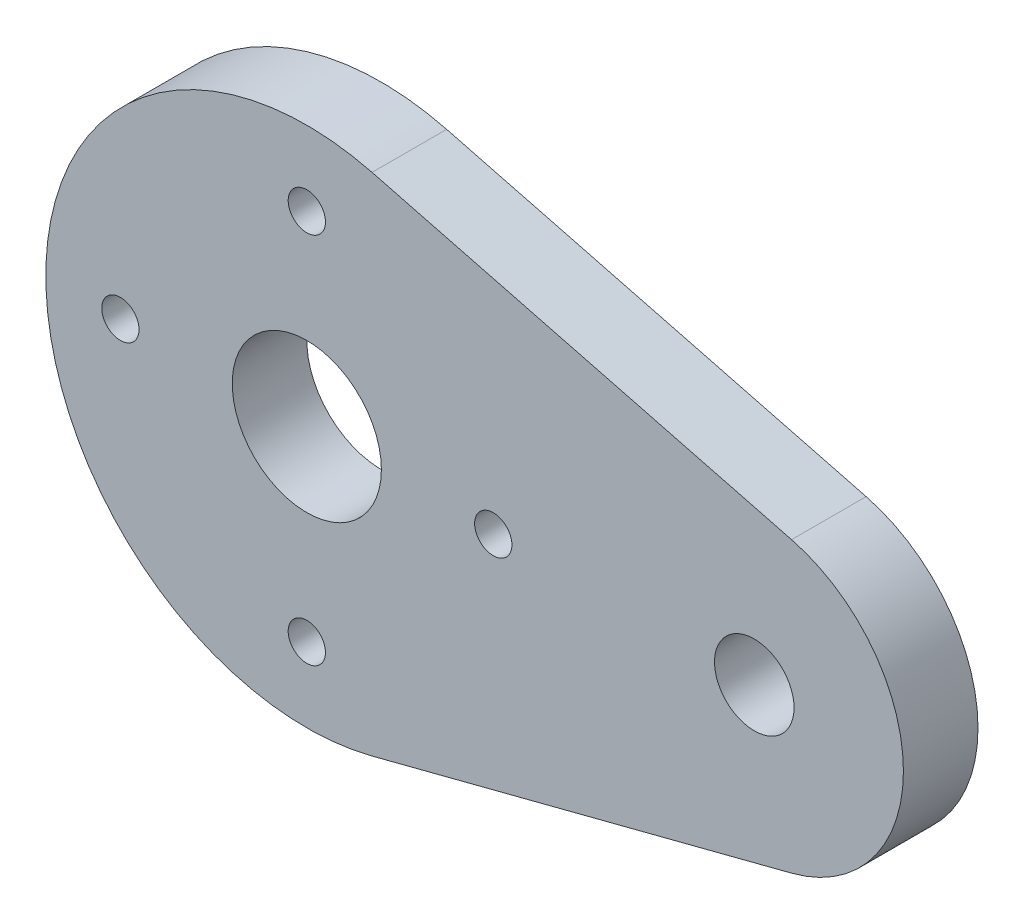
ISO-10303-21;
HEADER;
FILE_DESCRIPTION(('STEP AP214'),'2;1');
FILE_NAME('part.step','',(''),(''),'','','');
FILE_SCHEMA(('AUTOMOTIVE_DESIGN { 1 0 10303 214 1 1 1 1 }'));
ENDSEC;
DATA;
#1=APPLICATION_CONTEXT('core data for automotive mechanical design processes');
#2=APPLICATION_PROTOCOL_DEFINITION('international standard','automotive_design',2000,#1);
#3=PRODUCT_CONTEXT('',#1,'mechanical');
#4=PRODUCT('Part','Part','',(#3));
#5=PRODUCT_RELATED_PRODUCT_CATEGORY('part','',(#4));
#6=PRODUCT_DEFINITION_FORMATION('','',#4);
#7=PRODUCT_DEFINITION_CONTEXT('part definition',#1,'design');
#8=PRODUCT_DEFINITION('design','',#6,#7);
#9=PRODUCT_DEFINITION_SHAPE('','',#8);
#10=(LENGTH_UNIT() NAMED_UNIT(*) SI_UNIT(.MILLI.,.METRE.));
#11=(NAMED_UNIT(*) PLANE_ANGLE_UNIT() SI_UNIT($,.RADIAN.));
#12=(NAMED_UNIT(*) SI_UNIT($,.STERADIAN.) SOLID_ANGLE_UNIT());
#13=UNCERTAINTY_MEASURE_WITH_UNIT(LENGTH_MEASURE(1.E-05),#10,'distance_accuracy_value','');
#14=(GEOMETRIC_REPRESENTATION_CONTEXT(3) GLOBAL_UNCERTAINTY_ASSIGNED_CONTEXT((#13)) GLOBAL_UNIT_ASSIGNED_CONTEXT((#10,
#11,#12)) REPRESENTATION_CONTEXT('',''));
#15=CARTESIAN_POINT('',(0.,0.,0.));
#16=DIRECTION('',(0.,0.,1.));
#17=DIRECTION('',(1.,0.,0.));
#18=AXIS2_PLACEMENT_3D('',#15,#16,#17);
#19=CARTESIAN_POINT('',(0.,0.,3.));
#20=DIRECTION('',(0.,0.,1.));
#21=DIRECTION('',(1.,0.,0.));
#22=AXIS2_PLACEMENT_3D('',#19,#20,#21);
#23=PLANE('',#22);
#24=CARTESIAN_POINT('',(7.50000000000021,2.1224433562867E-13,3.));
#25=DIRECTION('',(0.,0.,1.));
#26=DIRECTION('',(1.,0.,0.));
#27=AXIS2_PLACEMENT_3D('',#24,#25,#26);
#28=CIRCLE('',#27,0.750000000000166);
#29=CARTESIAN_POINT('',(8.25000000000038,2.1224433562867E-13,3.));
#30=VERTEX_POINT('',#29);
#31=EDGE_CURVE('E141',#30,#30,#28,.T.);
#32=ORIENTED_EDGE('',*,*,#31,.F.);
#33=EDGE_LOOP('',(#32));
#34=FACE_BOUND('',#33,.T.);
#35=CARTESIAN_POINT('',(4.24488671257339E-13,-7.5,3.));
#36=DIRECTION('',(0.,0.,1.));
#37=DIRECTION('',(1.,0.,0.));
#38=AXIS2_PLACEMENT_3D('',#35,#36,#37);
#39=CIRCLE('',#38,0.750000000000456);
#40=CARTESIAN_POINT('',(0.75000000000088,-7.5,3.));
#41=VERTEX_POINT('',#40);
#42=EDGE_CURVE('E134',#41,#41,#39,.T.);
#43=ORIENTED_EDGE('',*,*,#42,.F.);
#44=EDGE_LOOP('',(#43));
#45=FACE_BOUND('',#44,.T.);
#46=CARTESIAN_POINT('',(-7.49999999999979,-2.1316282072803E-13,3.));
#47=DIRECTION('',(0.,0.,1.));
#48=DIRECTION('',(1.,0.,0.));
#49=AXIS2_PLACEMENT_3D('',#46,#47,#48);
#50=CIRCLE('',#49,0.750000000000341);
#51=CARTESIAN_POINT('',(-6.74999999999945,-2.1316282072803E-13,3.));
#52=VERTEX_POINT('',#51);
#53=EDGE_CURVE('E135',#52,#52,#50,.T.);
#54=ORIENTED_EDGE('',*,*,#53,.F.);
#55=EDGE_LOOP('',(#54));
#56=FACE_BOUND('',#55,.T.);
#57=CARTESIAN_POINT('',(0.,7.5,3.));
#58=DIRECTION('',(0.,0.,1.));
#59=DIRECTION('',(1.,0.,0.));
#60=AXIS2_PLACEMENT_3D('',#57,#58,#59);
#61=CIRCLE('',#60,0.75);
#62=CARTESIAN_POINT('',(0.75,7.5,3.));
#63=VERTEX_POINT('',#62);
#64=EDGE_CURVE('E127',#63,#63,#61,.T.);
#65=ORIENTED_EDGE('',*,*,#64,.F.);
#66=EDGE_LOOP('',(#65));
#67=FACE_BOUND('',#66,.T.);
#68=CARTESIAN_POINT('',(0.,0.,3.));
#69=DIRECTION('',(0.,0.,1.));
#70=DIRECTION('',(1.,0.,0.));
#71=AXIS2_PLACEMENT_3D('',#68,#69,#70);
#72=CIRCLE('',#71,3.);
#73=CARTESIAN_POINT('',(3.,0.,3.));
#74=VERTEX_POINT('',#73);
#75=EDGE_CURVE('E101',#74,#74,#72,.T.);
#76=ORIENTED_EDGE('',*,*,#75,.F.);
#77=EDGE_LOOP('',(#76));
#78=FACE_BOUND('',#77,.T.);
#79=CARTESIAN_POINT('',(0.,0.,3.));
#80=DIRECTION('',(0.,0.,1.));
#81=DIRECTION('',(1.,0.,0.));
#82=AXIS2_PLACEMENT_3D('',#79,#80,#81);
#83=CIRCLE('',#82,10.5);
#84=CARTESIAN_POINT('',(2.625,10.1665812837945,3.));
#85=VERTEX_POINT('',#84);
#86=CARTESIAN_POINT('',(2.625,-10.1665812837945,3.));
#87=VERTEX_POINT('',#86);
#88=EDGE_CURVE('E86',#85,#87,#83,.T.);
#89=ORIENTED_EDGE('',*,*,#88,.T.);
#90=DIRECTION('',(0.968245836551854,0.25,0.));
#91=VECTOR('',#90,1.);
#92=CARTESIAN_POINT('',(2.625,-10.1665812837945,3.));
#93=LINE('',#92,#91);
#94=CARTESIAN_POINT('',(19.5,-5.80947501931113,3.));
#95=VERTEX_POINT('',#94);
#96=EDGE_CURVE('E81',#87,#95,#93,.T.);
#97=ORIENTED_EDGE('',*,*,#96,.T.);
#98=CARTESIAN_POINT('',(18.,0.,3.));
#99=DIRECTION('',(0.,0.,1.));
#100=DIRECTION('',(1.,0.,0.));
#101=AXIS2_PLACEMENT_3D('',#98,#99,#100);
#102=CIRCLE('',#101,6.);
#103=CARTESIAN_POINT('',(19.5,5.80947501931113,3.));
#104=VERTEX_POINT('',#103);
#105=EDGE_CURVE('E84',#95,#104,#102,.T.);
#106=ORIENTED_EDGE('',*,*,#105,.T.);
#107=DIRECTION('',(-0.968245836551854,0.25,0.));
#108=VECTOR('',#107,1.);
#109=CARTESIAN_POINT('',(2.625,10.1665812837945,3.));
#110=LINE('',#109,#108);
#111=EDGE_CURVE('E51',#104,#85,#110,.T.);
#112=ORIENTED_EDGE('',*,*,#111,.T.);
#113=EDGE_LOOP('',(#89,#97,#106,#112));
#114=FACE_BOUND('',#113,.T.);
#115=CARTESIAN_POINT('',(18.,0.,3.));
#116=DIRECTION('',(0.,0.,1.));
#117=DIRECTION('',(1.,0.,0.));
#118=AXIS2_PLACEMENT_3D('',#115,#116,#117);
#119=CIRCLE('',#118,1.6);
#120=CARTESIAN_POINT('',(19.6,0.,3.));
#121=VERTEX_POINT('',#120);
#122=EDGE_CURVE('E116',#121,#121,#119,.T.);
#123=ORIENTED_EDGE('',*,*,#122,.F.);
#124=EDGE_LOOP('',(#123));
#125=FACE_BOUND('',#124,.T.);
#126=ADVANCED_FACE('F34',(#34,#45,#56,#67,#78,#114,#125),#23,.T.);
#127=CARTESIAN_POINT('',(0.,0.,0.));
#128=DIRECTION('',(0.,0.,1.));
#129=DIRECTION('',(1.,0.,0.));
#130=AXIS2_PLACEMENT_3D('',#127,#128,#129);
#131=PLANE('',#130);
#132=CARTESIAN_POINT('',(7.50000000000021,2.1224433562867E-13,0.));
#133=DIRECTION('',(0.,0.,1.));
#134=DIRECTION('',(1.,0.,0.));
#135=AXIS2_PLACEMENT_3D('',#132,#133,#134);
#136=CIRCLE('',#135,0.750000000000166);
#137=CARTESIAN_POINT('',(8.25000000000038,2.1224433562867E-13,0.));
#138=VERTEX_POINT('',#137);
#139=EDGE_CURVE('E130',#138,#138,#136,.F.);
#140=ORIENTED_EDGE('',*,*,#139,.F.);
#141=EDGE_LOOP('',(#140));
#142=FACE_BOUND('',#141,.T.);
#143=CARTESIAN_POINT('',(4.24488671257339E-13,-7.5,0.));
#144=DIRECTION('',(0.,0.,1.));
#145=DIRECTION('',(1.,0.,0.));
#146=AXIS2_PLACEMENT_3D('',#143,#144,#145);
#147=CIRCLE('',#146,0.750000000000456);
#148=CARTESIAN_POINT('',(0.75000000000088,-7.5,0.));
#149=VERTEX_POINT('',#148);
#150=EDGE_CURVE('E138',#149,#149,#147,.F.);
#151=ORIENTED_EDGE('',*,*,#150,.F.);
#152=EDGE_LOOP('',(#151));
#153=FACE_BOUND('',#152,.T.);
#154=CARTESIAN_POINT('',(-7.49999999999979,-2.1316282072803E-13,0.));
#155=DIRECTION('',(0.,0.,1.));
#156=DIRECTION('',(1.,0.,0.));
#157=AXIS2_PLACEMENT_3D('',#154,#155,#156);
#158=CIRCLE('',#157,0.750000000000341);
#159=CARTESIAN_POINT('',(-6.74999999999945,-2.1316282072803E-13,0.));
#160=VERTEX_POINT('',#159);
#161=EDGE_CURVE('E131',#160,#160,#158,.F.);
#162=ORIENTED_EDGE('',*,*,#161,.F.);
#163=EDGE_LOOP('',(#162));
#164=FACE_BOUND('',#163,.T.);
#165=CARTESIAN_POINT('',(0.,7.5,0.));
#166=DIRECTION('',(0.,0.,1.));
#167=DIRECTION('',(1.,0.,0.));
#168=AXIS2_PLACEMENT_3D('',#165,#166,#167);
#169=CIRCLE('',#168,0.75);
#170=CARTESIAN_POINT('',(0.75,7.5,0.));
#171=VERTEX_POINT('',#170);
#172=EDGE_CURVE('E122',#171,#171,#169,.F.);
#173=ORIENTED_EDGE('',*,*,#172,.F.);
#174=EDGE_LOOP('',(#173));
#175=FACE_BOUND('',#174,.T.);
#176=CARTESIAN_POINT('',(0.,0.,0.));
#177=DIRECTION('',(0.,0.,1.));
#178=DIRECTION('',(1.,0.,0.));
#179=AXIS2_PLACEMENT_3D('',#176,#177,#178);
#180=CIRCLE('',#179,10.5);
#181=CARTESIAN_POINT('',(2.625,10.1665812837945,0.));
#182=VERTEX_POINT('',#181);
#183=CARTESIAN_POINT('',(2.625,-10.1665812837945,0.));
#184=VERTEX_POINT('',#183);
#185=EDGE_CURVE('E98',#182,#184,#180,.T.);
#186=ORIENTED_EDGE('',*,*,#185,.F.);
#187=DIRECTION('',(-0.968245836551854,0.25,0.));
#188=VECTOR('',#187,1.);
#189=CARTESIAN_POINT('',(2.625,10.1665812837945,0.));
#190=LINE('',#189,#188);
#191=CARTESIAN_POINT('',(19.5,5.80947501931113,0.));
#192=VERTEX_POINT('',#191);
#193=EDGE_CURVE('E74',#192,#182,#190,.T.);
#194=ORIENTED_EDGE('',*,*,#193,.F.);
#195=CARTESIAN_POINT('',(18.,0.,0.));
#196=DIRECTION('',(0.,0.,1.));
#197=DIRECTION('',(1.,0.,0.));
#198=AXIS2_PLACEMENT_3D('',#195,#196,#197);
#199=CIRCLE('',#198,6.);
#200=CARTESIAN_POINT('',(19.5,-5.80947501931113,0.));
#201=VERTEX_POINT('',#200);
#202=EDGE_CURVE('E68',#201,#192,#199,.T.);
#203=ORIENTED_EDGE('',*,*,#202,.F.);
#204=DIRECTION('',(0.968245836551854,0.25,0.));
#205=VECTOR('',#204,1.);
#206=CARTESIAN_POINT('',(2.625,-10.1665812837945,0.));
#207=LINE('',#206,#205);
#208=EDGE_CURVE('E90',#184,#201,#207,.T.);
#209=ORIENTED_EDGE('',*,*,#208,.F.);
#210=EDGE_LOOP('',(#186,#194,#203,#209));
#211=FACE_BOUND('',#210,.T.);
#212=CARTESIAN_POINT('',(0.,0.,0.));
#213=DIRECTION('',(0.,0.,1.));
#214=DIRECTION('',(1.,0.,0.));
#215=AXIS2_PLACEMENT_3D('',#212,#213,#214);
#216=CIRCLE('',#215,3.);
#217=CARTESIAN_POINT('',(3.,0.,0.));
#218=VERTEX_POINT('',#217);
#219=EDGE_CURVE('E113',#218,#218,#216,.T.);
#220=ORIENTED_EDGE('',*,*,#219,.T.);
#221=EDGE_LOOP('',(#220));
#222=FACE_BOUND('',#221,.T.);
#223=CARTESIAN_POINT('',(18.,0.,0.));
#224=DIRECTION('',(0.,0.,1.));
#225=DIRECTION('',(1.,0.,0.));
#226=AXIS2_PLACEMENT_3D('',#223,#224,#225);
#227=CIRCLE('',#226,1.6);
#228=CARTESIAN_POINT('',(19.6,0.,0.));
#229=VERTEX_POINT('',#228);
#230=EDGE_CURVE('E119',#229,#229,#227,.T.);
#231=ORIENTED_EDGE('',*,*,#230,.T.);
#232=EDGE_LOOP('',(#231));
#233=FACE_BOUND('',#232,.T.);
#234=ADVANCED_FACE('F109',(#142,#153,#164,#175,#211,#222,#233),#131,.F.);
#235=CARTESIAN_POINT('',(0.,0.,3.));
#236=DIRECTION('',(0.,0.,-1.));
#237=DIRECTION('',(-1.,0.,0.));
#238=AXIS2_PLACEMENT_3D('',#235,#236,#237);
#239=CYLINDRICAL_SURFACE('',#238,10.5);
#240=ORIENTED_EDGE('',*,*,#185,.T.);
#241=DIRECTION('',(0.,0.,-1.));
#242=VECTOR('',#241,1.);
#243=CARTESIAN_POINT('',(2.625,-10.1665812837945,3.));
#244=LINE('',#243,#242);
#245=EDGE_CURVE('E11',#87,#184,#244,.T.);
#246=ORIENTED_EDGE('',*,*,#245,.F.);
#247=ORIENTED_EDGE('',*,*,#88,.F.);
#248=DIRECTION('',(0.,0.,-1.));
#249=VECTOR('',#248,1.);
#250=CARTESIAN_POINT('',(2.625,10.1665812837945,3.));
#251=LINE('',#250,#249);
#252=EDGE_CURVE('E94',#85,#182,#251,.T.);
#253=ORIENTED_EDGE('',*,*,#252,.T.);
#254=EDGE_LOOP('',(#240,#246,#247,#253));
#255=FACE_BOUND('',#254,.T.);
#256=ADVANCED_FACE('F36',(#255),#239,.T.);
#257=CARTESIAN_POINT('',(2.625,-10.1665812837945,3.));
#258=DIRECTION('',(-0.25,0.968245836551854,0.));
#259=DIRECTION('',(-0.968245836551854,-0.25,0.));
#260=AXIS2_PLACEMENT_3D('',#257,#258,#259);
#261=PLANE('',#260);
#262=ORIENTED_EDGE('',*,*,#208,.T.);
#263=DIRECTION('',(0.,0.,-1.));
#264=VECTOR('',#263,1.);
#265=CARTESIAN_POINT('',(19.5,-5.80947501931113,3.));
#266=LINE('',#265,#264);
#267=EDGE_CURVE('E43',#95,#201,#266,.T.);
#268=ORIENTED_EDGE('',*,*,#267,.F.);
#269=ORIENTED_EDGE('',*,*,#96,.F.);
#270=ORIENTED_EDGE('',*,*,#245,.T.);
#271=EDGE_LOOP('',(#262,#268,#269,#270));
#272=FACE_BOUND('',#271,.T.);
#273=ADVANCED_FACE('F89',(#272),#261,.F.);
#274=CARTESIAN_POINT('',(18.,0.,3.));
#275=DIRECTION('',(0.,0.,-1.));
#276=DIRECTION('',(-1.,0.,0.));
#277=AXIS2_PLACEMENT_3D('',#274,#275,#276);
#278=CYLINDRICAL_SURFACE('',#277,6.);
#279=ORIENTED_EDGE('',*,*,#202,.T.);
#280=DIRECTION('',(0.,0.,-1.));
#281=VECTOR('',#280,1.);
#282=CARTESIAN_POINT('',(19.5,5.80947501931113,3.));
#283=LINE('',#282,#281);
#284=EDGE_CURVE('E91',#104,#192,#283,.T.);
#285=ORIENTED_EDGE('',*,*,#284,.F.);
#286=ORIENTED_EDGE('',*,*,#105,.F.);
#287=ORIENTED_EDGE('',*,*,#267,.T.);
#288=EDGE_LOOP('',(#279,#285,#286,#287));
#289=FACE_BOUND('',#288,.T.);
#290=ADVANCED_FACE('F92',(#289),#278,.T.);
#291=CARTESIAN_POINT('',(2.625,10.1665812837945,3.));
#292=DIRECTION('',(-0.25,-0.968245836551854,0.));
#293=DIRECTION('',(0.968245836551854,-0.25,0.));
#294=AXIS2_PLACEMENT_3D('',#291,#292,#293);
#295=PLANE('',#294);
#296=ORIENTED_EDGE('',*,*,#193,.T.);
#297=ORIENTED_EDGE('',*,*,#252,.F.);
#298=ORIENTED_EDGE('',*,*,#111,.F.);
#299=ORIENTED_EDGE('',*,*,#284,.T.);
#300=EDGE_LOOP('',(#296,#297,#298,#299));
#301=FACE_BOUND('',#300,.T.);
#302=ADVANCED_FACE('F106',(#301),#295,.F.);
#303=CARTESIAN_POINT('',(0.,0.,3.));
#304=DIRECTION('',(0.,0.,-1.));
#305=DIRECTION('',(-1.,0.,0.));
#306=AXIS2_PLACEMENT_3D('',#303,#304,#305);
#307=CYLINDRICAL_SURFACE('',#306,3.);
#308=ORIENTED_EDGE('',*,*,#75,.T.);
#309=EDGE_LOOP('',(#308));
#310=FACE_BOUND('',#309,.T.);
#311=ORIENTED_EDGE('',*,*,#219,.F.);
#312=EDGE_LOOP('',(#311));
#313=FACE_BOUND('',#312,.T.);
#314=ADVANCED_FACE('F163',(#310,#313),#307,.F.);
#315=CARTESIAN_POINT('',(18.,0.,3.));
#316=DIRECTION('',(0.,0.,-1.));
#317=DIRECTION('',(-1.,0.,0.));
#318=AXIS2_PLACEMENT_3D('',#315,#316,#317);
#319=CYLINDRICAL_SURFACE('',#318,1.6);
#320=ORIENTED_EDGE('',*,*,#122,.T.);
#321=EDGE_LOOP('',(#320));
#322=FACE_BOUND('',#321,.T.);
#323=ORIENTED_EDGE('',*,*,#230,.F.);
#324=EDGE_LOOP('',(#323));
#325=FACE_BOUND('',#324,.T.);
#326=ADVANCED_FACE('F166',(#322,#325),#319,.F.);
#327=CARTESIAN_POINT('',(0.,7.5,-0.00100000000000013));
#328=DIRECTION('',(0.,0.,1.));
#329=DIRECTION('',(1.,0.,0.));
#330=AXIS2_PLACEMENT_3D('',#327,#328,#329);
#331=CYLINDRICAL_SURFACE('',#330,0.75);
#332=ORIENTED_EDGE('',*,*,#64,.T.);
#333=EDGE_LOOP('',(#332));
#334=FACE_BOUND('',#333,.T.);
#335=ORIENTED_EDGE('',*,*,#172,.T.);
#336=EDGE_LOOP('',(#335));
#337=FACE_BOUND('',#336,.T.);
#338=ADVANCED_FACE('F176',(#334,#337),#331,.F.);
#339=CARTESIAN_POINT('',(-7.49999999999979,-2.1316282072803E-13,-0.00100000000000013));
#340=DIRECTION('',(0.,0.,1.));
#341=DIRECTION('',(1.,0.,0.));
#342=AXIS2_PLACEMENT_3D('',#339,#340,#341);
#343=CYLINDRICAL_SURFACE('',#342,0.750000000000341);
#344=ORIENTED_EDGE('',*,*,#53,.T.);
#345=EDGE_LOOP('',(#344));
#346=FACE_BOUND('',#345,.T.);
#347=ORIENTED_EDGE('',*,*,#161,.T.);
#348=EDGE_LOOP('',(#347));
#349=FACE_BOUND('',#348,.T.);
#350=ADVANCED_FACE('F182',(#346,#349),#343,.F.);
#351=CARTESIAN_POINT('',(4.24488671257339E-13,-7.5,-0.00100000000000013));
#352=DIRECTION('',(0.,0.,1.));
#353=DIRECTION('',(1.,0.,0.));
#354=AXIS2_PLACEMENT_3D('',#351,#352,#353);
#355=CYLINDRICAL_SURFACE('',#354,0.750000000000456);
#356=ORIENTED_EDGE('',*,*,#42,.T.);
#357=EDGE_LOOP('',(#356));
#358=FACE_BOUND('',#357,.T.);
#359=ORIENTED_EDGE('',*,*,#150,.T.);
#360=EDGE_LOOP('',(#359));
#361=FACE_BOUND('',#360,.T.);
#362=ADVANCED_FACE('F249',(#358,#361),#355,.F.);
#363=CARTESIAN_POINT('',(7.50000000000021,2.1224433562867E-13,-0.00100000000000013));
#364=DIRECTION('',(0.,0.,1.));
#365=DIRECTION('',(1.,0.,0.));
#366=AXIS2_PLACEMENT_3D('',#363,#364,#365);
#367=CYLINDRICAL_SURFACE('',#366,0.750000000000166);
#368=ORIENTED_EDGE('',*,*,#31,.T.);
#369=EDGE_LOOP('',(#368));
#370=FACE_BOUND('',#369,.T.);
#371=ORIENTED_EDGE('',*,*,#139,.T.);
#372=EDGE_LOOP('',(#371));
#373=FACE_BOUND('',#372,.T.);
#374=ADVANCED_FACE('F149',(#370,#373),#367,.F.);
#375=CLOSED_SHELL('',(#126,#234,#256,#273,#290,#302,#314,#326,#338,#350,#362,#374));
#376=MANIFOLD_SOLID_BREP('B2',#375);
#377=ADVANCED_BREP_SHAPE_REPRESENTATION('',(#18,#376),#14);
#378=SHAPE_DEFINITION_REPRESENTATION(#9,#377);
ENDSEC;
END-ISO-10303-21;
